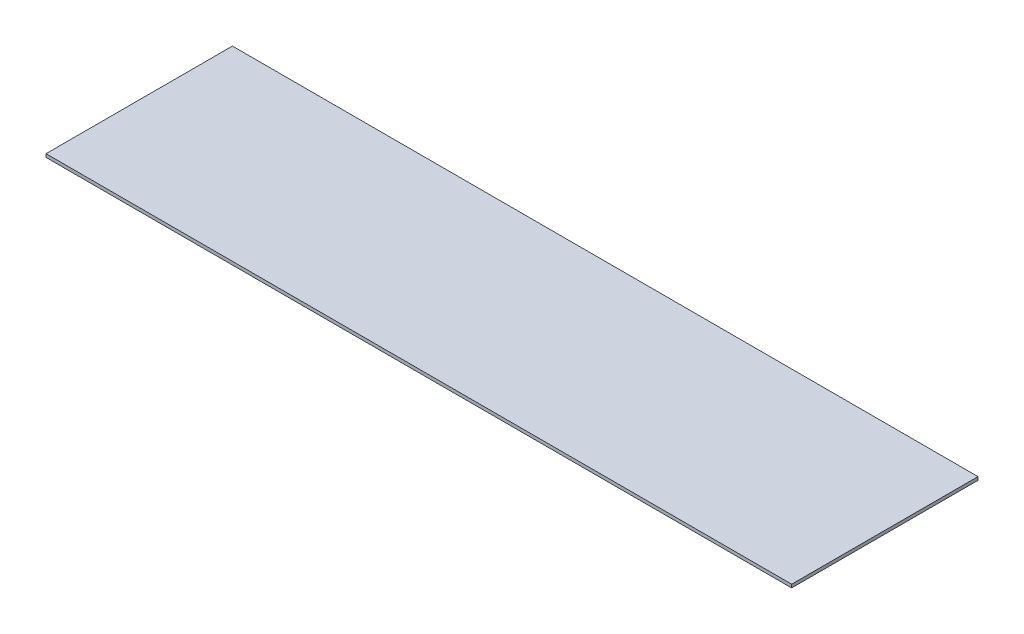
ISO-10303-21;
HEADER;
FILE_DESCRIPTION(('STEP AP214'),'2;1');
FILE_NAME('part.step','',(''),(''),'','','');
FILE_SCHEMA(('AUTOMOTIVE_DESIGN { 1 0 10303 214 1 1 1 1 }'));
ENDSEC;
DATA;
#1=APPLICATION_CONTEXT('core data for automotive mechanical design processes');
#2=APPLICATION_PROTOCOL_DEFINITION('international standard','automotive_design',2000,#1);
#3=PRODUCT_CONTEXT('',#1,'mechanical');
#4=PRODUCT('Part','Part','',(#3));
#5=PRODUCT_RELATED_PRODUCT_CATEGORY('part','',(#4));
#6=PRODUCT_DEFINITION_FORMATION('','',#4);
#7=PRODUCT_DEFINITION_CONTEXT('part definition',#1,'design');
#8=PRODUCT_DEFINITION('design','',#6,#7);
#9=PRODUCT_DEFINITION_SHAPE('','',#8);
#10=(LENGTH_UNIT() NAMED_UNIT(*) SI_UNIT(.MILLI.,.METRE.));
#11=(NAMED_UNIT(*) PLANE_ANGLE_UNIT() SI_UNIT($,.RADIAN.));
#12=(NAMED_UNIT(*) SI_UNIT($,.STERADIAN.) SOLID_ANGLE_UNIT());
#13=UNCERTAINTY_MEASURE_WITH_UNIT(LENGTH_MEASURE(1.E-05),#10,'distance_accuracy_value','');
#14=(GEOMETRIC_REPRESENTATION_CONTEXT(3) GLOBAL_UNCERTAINTY_ASSIGNED_CONTEXT((#13)) GLOBAL_UNIT_ASSIGNED_CONTEXT((#10,
#11,#12)) REPRESENTATION_CONTEXT('',''));
#15=CARTESIAN_POINT('',(0.,0.,0.));
#16=DIRECTION('',(0.,0.,1.));
#17=DIRECTION('',(1.,0.,0.));
#18=AXIS2_PLACEMENT_3D('',#15,#16,#17);
#19=CARTESIAN_POINT('',(4000.00008311268,35.,-183.933312446768));
#20=DIRECTION('',(-0.999999999999999,0.,-4.15720320817164E-08));
#21=DIRECTION('',(-4.15720320817164E-08,0.,0.999999999999999));
#22=AXIS2_PLACEMENT_3D('',#19,#20,#21);
#23=PLANE('',#22);
#24=DIRECTION('',(4.15720320817164E-08,0.,-0.999999999999999));
#25=VECTOR('',#24,1.);
#26=CARTESIAN_POINT('',(4000.00008311268,0.,-183.933312446768));
#27=LINE('',#26,#25);
#28=CARTESIAN_POINT('',(4000.,0.,1815.31176006314));
#29=VERTEX_POINT('',#28);
#30=CARTESIAN_POINT('',(4000.00008311268,0.,-183.933312446768));
#31=VERTEX_POINT('',#30);
#32=EDGE_CURVE('E113',#29,#31,#27,.T.);
#33=ORIENTED_EDGE('',*,*,#32,.T.);
#34=DIRECTION('',(0.,-1.,0.));
#35=VECTOR('',#34,1.);
#36=CARTESIAN_POINT('',(4000.00008311268,35.,-183.933312446768));
#37=LINE('',#36,#35);
#38=CARTESIAN_POINT('',(4000.00008311268,35.,-183.933312446768));
#39=VERTEX_POINT('',#38);
#40=EDGE_CURVE('E11',#39,#31,#37,.T.);
#41=ORIENTED_EDGE('',*,*,#40,.F.);
#42=DIRECTION('',(4.15720320817164E-08,0.,-0.999999999999999));
#43=VECTOR('',#42,1.);
#44=CARTESIAN_POINT('',(4000.00008311268,35.,-183.933312446768));
#45=LINE('',#44,#43);
#46=CARTESIAN_POINT('',(4000.,35.,1815.31176006314));
#47=VERTEX_POINT('',#46);
#48=EDGE_CURVE('E97',#47,#39,#45,.T.);
#49=ORIENTED_EDGE('',*,*,#48,.F.);
#50=DIRECTION('',(0.,-1.,0.));
#51=VECTOR('',#50,1.);
#52=CARTESIAN_POINT('',(4000.,35.,1815.31176006314));
#53=LINE('',#52,#51);
#54=EDGE_CURVE('E109',#47,#29,#53,.T.);
#55=ORIENTED_EDGE('',*,*,#54,.T.);
#56=EDGE_LOOP('',(#33,#41,#49,#55));
#57=FACE_BOUND('',#56,.T.);
#58=ADVANCED_FACE('F45',(#57),#23,.F.);
#59=CARTESIAN_POINT('',(-3999.9998812676,35.,-184.688239936855));
#60=DIRECTION('',(-9.4365936260804E-05,0.,0.999999995547535));
#61=DIRECTION('',(0.999999995547535,0.,9.4365936260804E-05));
#62=AXIS2_PLACEMENT_3D('',#59,#60,#61);
#63=PLANE('',#62);
#64=DIRECTION('',(-0.999999995547535,0.,-9.4365936260804E-05));
#65=VECTOR('',#64,1.);
#66=CARTESIAN_POINT('',(-3999.9998812676,0.,-184.688239936855));
#67=LINE('',#66,#65);
#68=CARTESIAN_POINT('',(-3999.9998812676,0.,-184.688239936855));
#69=VERTEX_POINT('',#68);
#70=EDGE_CURVE('E102',#31,#69,#67,.T.);
#71=ORIENTED_EDGE('',*,*,#70,.T.);
#72=DIRECTION('',(0.,-1.,0.));
#73=VECTOR('',#72,1.);
#74=CARTESIAN_POINT('',(-3999.9998812676,35.,-184.688239936855));
#75=LINE('',#74,#73);
#76=CARTESIAN_POINT('',(-3999.9998812676,35.,-184.688239936855));
#77=VERTEX_POINT('',#76);
#78=EDGE_CURVE('E54',#77,#69,#75,.T.);
#79=ORIENTED_EDGE('',*,*,#78,.F.);
#80=DIRECTION('',(-0.999999995547535,0.,-9.4365936260804E-05));
#81=VECTOR('',#80,1.);
#82=CARTESIAN_POINT('',(-3999.9998812676,35.,-184.688239936855));
#83=LINE('',#82,#81);
#84=EDGE_CURVE('E92',#39,#77,#83,.T.);
#85=ORIENTED_EDGE('',*,*,#84,.F.);
#86=ORIENTED_EDGE('',*,*,#40,.T.);
#87=EDGE_LOOP('',(#71,#79,#85,#86));
#88=FACE_BOUND('',#87,.T.);
#89=ADVANCED_FACE('F101',(#88),#63,.F.);
#90=CARTESIAN_POINT('',(-3999.9998812676,35.,-184.688239936855));
#91=DIRECTION('',(0.999999999999998,0.,5.9366199289812E-08));
#92=DIRECTION('',(5.9366199289812E-08,0.,-0.999999999999998));
#93=AXIS2_PLACEMENT_3D('',#90,#91,#92);
#94=PLANE('',#93);
#95=DIRECTION('',(-5.9366199289812E-08,0.,0.999999999999998));
#96=VECTOR('',#95,1.);
#97=CARTESIAN_POINT('',(-3999.9998812676,0.,-184.688239936855));
#98=LINE('',#97,#96);
#99=CARTESIAN_POINT('',(-4000.,0.,1815.31176006314));
#100=VERTEX_POINT('',#99);
#101=EDGE_CURVE('E79',#69,#100,#98,.T.);
#102=ORIENTED_EDGE('',*,*,#101,.T.);
#103=DIRECTION('',(0.,-1.,0.));
#104=VECTOR('',#103,1.);
#105=CARTESIAN_POINT('',(-4000.,35.,1815.31176006314));
#106=LINE('',#105,#104);
#107=CARTESIAN_POINT('',(-4000.,35.,1815.31176006314));
#108=VERTEX_POINT('',#107);
#109=EDGE_CURVE('E104',#108,#100,#106,.T.);
#110=ORIENTED_EDGE('',*,*,#109,.F.);
#111=DIRECTION('',(-5.9366199289812E-08,0.,0.999999999999998));
#112=VECTOR('',#111,1.);
#113=CARTESIAN_POINT('',(-3999.9998812676,35.,-184.688239936855));
#114=LINE('',#113,#112);
#115=EDGE_CURVE('E95',#77,#108,#114,.T.);
#116=ORIENTED_EDGE('',*,*,#115,.F.);
#117=ORIENTED_EDGE('',*,*,#78,.T.);
#118=EDGE_LOOP('',(#102,#110,#116,#117));
#119=FACE_BOUND('',#118,.T.);
#120=ADVANCED_FACE('F105',(#119),#94,.F.);
#121=CARTESIAN_POINT('',(-4000.,35.,1815.31176006314));
#122=DIRECTION('',(0.,0.,-1.));
#123=DIRECTION('',(-1.,0.,0.));
#124=AXIS2_PLACEMENT_3D('',#121,#122,#123);
#125=PLANE('',#124);
#126=DIRECTION('',(1.,0.,0.));
#127=VECTOR('',#126,1.);
#128=CARTESIAN_POINT('',(-4000.,0.,1815.31176006314));
#129=LINE('',#128,#127);
#130=EDGE_CURVE('E85',#100,#29,#129,.T.);
#131=ORIENTED_EDGE('',*,*,#130,.T.);
#132=ORIENTED_EDGE('',*,*,#54,.F.);
#133=DIRECTION('',(1.,0.,0.));
#134=VECTOR('',#133,1.);
#135=CARTESIAN_POINT('',(-4000.,35.,1815.31176006314));
#136=LINE('',#135,#134);
#137=EDGE_CURVE('E62',#108,#47,#136,.T.);
#138=ORIENTED_EDGE('',*,*,#137,.F.);
#139=ORIENTED_EDGE('',*,*,#109,.T.);
#140=EDGE_LOOP('',(#131,#132,#138,#139));
#141=FACE_BOUND('',#140,.T.);
#142=ADVANCED_FACE('F126',(#141),#125,.F.);
#143=CARTESIAN_POINT('',(0.,35.,0.));
#144=DIRECTION('',(0.,1.,0.));
#145=DIRECTION('',(0.,0.,1.));
#146=AXIS2_PLACEMENT_3D('',#143,#144,#145);
#147=PLANE('',#146);
#148=ORIENTED_EDGE('',*,*,#48,.T.);
#149=ORIENTED_EDGE('',*,*,#84,.T.);
#150=ORIENTED_EDGE('',*,*,#115,.T.);
#151=ORIENTED_EDGE('',*,*,#137,.T.);
#152=EDGE_LOOP('',(#148,#149,#150,#151));
#153=FACE_BOUND('',#152,.T.);
#154=ADVANCED_FACE('F93',(#153),#147,.T.);
#155=CARTESIAN_POINT('',(0.,0.,0.));
#156=DIRECTION('',(0.,1.,0.));
#157=DIRECTION('',(0.,0.,1.));
#158=AXIS2_PLACEMENT_3D('',#155,#156,#157);
#159=PLANE('',#158);
#160=ORIENTED_EDGE('',*,*,#32,.F.);
#161=ORIENTED_EDGE('',*,*,#130,.F.);
#162=ORIENTED_EDGE('',*,*,#101,.F.);
#163=ORIENTED_EDGE('',*,*,#70,.F.);
#164=EDGE_LOOP('',(#160,#161,#162,#163));
#165=FACE_BOUND('',#164,.T.);
#166=ADVANCED_FACE('F129',(#165),#159,.F.);
#167=CLOSED_SHELL('',(#58,#89,#120,#142,#154,#166));
#168=MANIFOLD_SOLID_BREP('B2',#167);
#169=ADVANCED_BREP_SHAPE_REPRESENTATION('',(#18,#168),#14);
#170=SHAPE_DEFINITION_REPRESENTATION(#9,#169);
ENDSEC;
END-ISO-10303-21;
